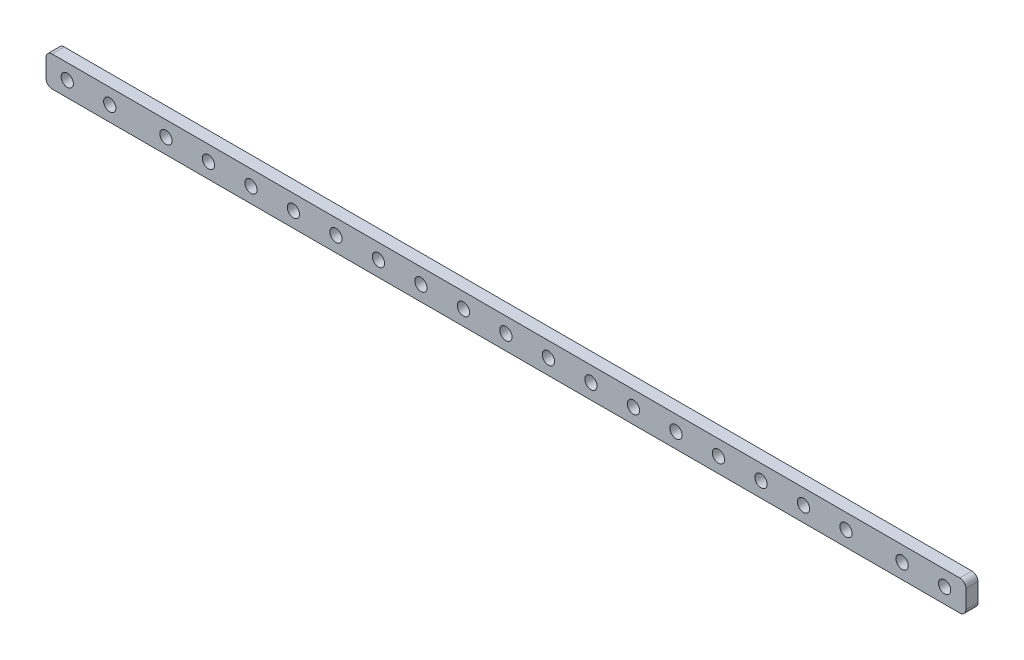
ISO-10303-21;
HEADER;
FILE_DESCRIPTION(('STEP AP214'),'2;1');
FILE_NAME('part.step','',(''),(''),'','','');
FILE_SCHEMA(('AUTOMOTIVE_DESIGN { 1 0 10303 214 1 1 1 1 }'));
ENDSEC;
DATA;
#1=APPLICATION_CONTEXT('core data for automotive mechanical design processes');
#2=APPLICATION_PROTOCOL_DEFINITION('international standard','automotive_design',2000,#1);
#3=PRODUCT_CONTEXT('',#1,'mechanical');
#4=PRODUCT('Part','Part','',(#3));
#5=PRODUCT_RELATED_PRODUCT_CATEGORY('part','',(#4));
#6=PRODUCT_DEFINITION_FORMATION('','',#4);
#7=PRODUCT_DEFINITION_CONTEXT('part definition',#1,'design');
#8=PRODUCT_DEFINITION('design','',#6,#7);
#9=PRODUCT_DEFINITION_SHAPE('','',#8);
#10=(LENGTH_UNIT() NAMED_UNIT(*) SI_UNIT(.MILLI.,.METRE.));
#11=(NAMED_UNIT(*) PLANE_ANGLE_UNIT() SI_UNIT($,.RADIAN.));
#12=(NAMED_UNIT(*) SI_UNIT($,.STERADIAN.) SOLID_ANGLE_UNIT());
#13=UNCERTAINTY_MEASURE_WITH_UNIT(LENGTH_MEASURE(1.E-05),#10,'distance_accuracy_value','');
#14=(GEOMETRIC_REPRESENTATION_CONTEXT(3) GLOBAL_UNCERTAINTY_ASSIGNED_CONTEXT((#13)) GLOBAL_UNIT_ASSIGNED_CONTEXT((#10,
#11,#12)) REPRESENTATION_CONTEXT('',''));
#15=CARTESIAN_POINT('',(0.,0.,0.));
#16=DIRECTION('',(0.,0.,1.));
#17=DIRECTION('',(1.,0.,0.));
#18=AXIS2_PLACEMENT_3D('',#15,#16,#17);
#19=CARTESIAN_POINT('',(0.,0.,4.));
#20=DIRECTION('',(0.,0.,-1.));
#21=DIRECTION('',(-1.,0.,0.));
#22=AXIS2_PLACEMENT_3D('',#19,#20,#21);
#23=PLANE('',#22);
#24=DIRECTION('',(1.,0.,0.));
#25=VECTOR('',#24,1.);
#26=CARTESIAN_POINT('',(-151.5,-5.,4.));
#27=LINE('',#26,#25);
#28=CARTESIAN_POINT('',(-149.5,-5.,4.));
#29=VERTEX_POINT('',#28);
#30=CARTESIAN_POINT('',(149.5,-5.,4.));
#31=VERTEX_POINT('',#30);
#32=EDGE_CURVE('E139',#29,#31,#27,.T.);
#33=ORIENTED_EDGE('',*,*,#32,.T.);
#34=CARTESIAN_POINT('',(149.5,-3.,4.));
#35=DIRECTION('',(0.,0.,-1.));
#36=DIRECTION('',(-1.,0.,0.));
#37=AXIS2_PLACEMENT_3D('',#34,#35,#36);
#38=CIRCLE('',#37,2.);
#39=CARTESIAN_POINT('',(151.5,-3.,4.));
#40=VERTEX_POINT('',#39);
#41=EDGE_CURVE('E157',#31,#40,#38,.F.);
#42=ORIENTED_EDGE('',*,*,#41,.T.);
#43=DIRECTION('',(0.,1.,0.));
#44=VECTOR('',#43,1.);
#45=CARTESIAN_POINT('',(151.5,-5.,4.));
#46=LINE('',#45,#44);
#47=CARTESIAN_POINT('',(151.5,3.,4.));
#48=VERTEX_POINT('',#47);
#49=EDGE_CURVE('E121',#40,#48,#46,.T.);
#50=ORIENTED_EDGE('',*,*,#49,.T.);
#51=CARTESIAN_POINT('',(149.5,3.,4.));
#52=DIRECTION('',(0.,0.,-1.));
#53=DIRECTION('',(-1.,0.,0.));
#54=AXIS2_PLACEMENT_3D('',#51,#52,#53);
#55=CIRCLE('',#54,2.);
#56=CARTESIAN_POINT('',(149.5,5.,4.));
#57=VERTEX_POINT('',#56);
#58=EDGE_CURVE('E153',#48,#57,#55,.F.);
#59=ORIENTED_EDGE('',*,*,#58,.T.);
#60=DIRECTION('',(-1.,0.,0.));
#61=VECTOR('',#60,1.);
#62=CARTESIAN_POINT('',(-151.5,5.,4.));
#63=LINE('',#62,#61);
#64=CARTESIAN_POINT('',(-149.5,5.,4.));
#65=VERTEX_POINT('',#64);
#66=EDGE_CURVE('E166',#57,#65,#63,.T.);
#67=ORIENTED_EDGE('',*,*,#66,.T.);
#68=CARTESIAN_POINT('',(-149.5,3.,4.));
#69=DIRECTION('',(0.,0.,-1.));
#70=DIRECTION('',(-1.,0.,0.));
#71=AXIS2_PLACEMENT_3D('',#68,#69,#70);
#72=CIRCLE('',#71,2.);
#73=CARTESIAN_POINT('',(-151.5,3.,4.));
#74=VERTEX_POINT('',#73);
#75=EDGE_CURVE('E56',#65,#74,#72,.F.);
#76=ORIENTED_EDGE('',*,*,#75,.T.);
#77=DIRECTION('',(0.,-1.,0.));
#78=VECTOR('',#77,1.);
#79=CARTESIAN_POINT('',(-151.5,-5.,4.));
#80=LINE('',#79,#78);
#81=CARTESIAN_POINT('',(-151.5,-3.,4.));
#82=VERTEX_POINT('',#81);
#83=EDGE_CURVE('E172',#74,#82,#80,.T.);
#84=ORIENTED_EDGE('',*,*,#83,.T.);
#85=CARTESIAN_POINT('',(-149.5,-3.,4.));
#86=DIRECTION('',(0.,0.,-1.));
#87=DIRECTION('',(-1.,0.,0.));
#88=AXIS2_PLACEMENT_3D('',#85,#86,#87);
#89=CIRCLE('',#88,2.);
#90=EDGE_CURVE('E155',#82,#29,#89,.F.);
#91=ORIENTED_EDGE('',*,*,#90,.T.);
#92=EDGE_LOOP('',(#33,#42,#50,#59,#67,#76,#84,#91));
#93=FACE_BOUND('',#92,.T.);
#94=CARTESIAN_POINT('',(-112.,0.,4.));
#95=DIRECTION('',(0.,0.,1.));
#96=DIRECTION('',(1.,0.,0.));
#97=AXIS2_PLACEMENT_3D('',#94,#95,#96);
#98=CIRCLE('',#97,2.02500000000001);
#99=CARTESIAN_POINT('',(-109.975,0.,4.));
#100=VERTEX_POINT('',#99);
#101=EDGE_CURVE('E130',#100,#100,#98,.T.);
#102=ORIENTED_EDGE('',*,*,#101,.F.);
#103=EDGE_LOOP('',(#102));
#104=FACE_BOUND('',#103,.T.);
#105=CARTESIAN_POINT('',(-97.9999999999999,0.,4.));
#106=DIRECTION('',(0.,0.,1.));
#107=DIRECTION('',(1.,0.,0.));
#108=AXIS2_PLACEMENT_3D('',#105,#106,#107);
#109=CIRCLE('',#108,2.02500000000001);
#110=CARTESIAN_POINT('',(-95.9749999999999,0.,4.));
#111=VERTEX_POINT('',#110);
#112=EDGE_CURVE('E187',#111,#111,#109,.T.);
#113=ORIENTED_EDGE('',*,*,#112,.F.);
#114=EDGE_LOOP('',(#113));
#115=FACE_BOUND('',#114,.T.);
#116=CARTESIAN_POINT('',(-130.5,0.,4.));
#117=DIRECTION('',(0.,0.,1.));
#118=DIRECTION('',(1.,0.,0.));
#119=AXIS2_PLACEMENT_3D('',#116,#117,#118);
#120=CIRCLE('',#119,2.02500000000001);
#121=CARTESIAN_POINT('',(-128.475,0.,4.));
#122=VERTEX_POINT('',#121);
#123=EDGE_CURVE('E192',#122,#122,#120,.T.);
#124=ORIENTED_EDGE('',*,*,#123,.F.);
#125=EDGE_LOOP('',(#124));
#126=FACE_BOUND('',#125,.T.);
#127=CARTESIAN_POINT('',(-83.9999999999999,0.,4.));
#128=DIRECTION('',(0.,0.,1.));
#129=DIRECTION('',(1.,0.,0.));
#130=AXIS2_PLACEMENT_3D('',#127,#128,#129);
#131=CIRCLE('',#130,2.02499999999999);
#132=CARTESIAN_POINT('',(-81.9749999999999,0.,4.));
#133=VERTEX_POINT('',#132);
#134=EDGE_CURVE('E198',#133,#133,#131,.T.);
#135=ORIENTED_EDGE('',*,*,#134,.F.);
#136=EDGE_LOOP('',(#135));
#137=FACE_BOUND('',#136,.T.);
#138=CARTESIAN_POINT('',(-69.9999999999999,0.,4.));
#139=DIRECTION('',(0.,0.,1.));
#140=DIRECTION('',(1.,0.,0.));
#141=AXIS2_PLACEMENT_3D('',#138,#139,#140);
#142=CIRCLE('',#141,2.02499999999999);
#143=CARTESIAN_POINT('',(-67.9749999999999,0.,4.));
#144=VERTEX_POINT('',#143);
#145=EDGE_CURVE('E204',#144,#144,#142,.T.);
#146=ORIENTED_EDGE('',*,*,#145,.F.);
#147=EDGE_LOOP('',(#146));
#148=FACE_BOUND('',#147,.T.);
#149=CARTESIAN_POINT('',(-55.9999999999999,0.,4.));
#150=DIRECTION('',(0.,0.,1.));
#151=DIRECTION('',(1.,0.,0.));
#152=AXIS2_PLACEMENT_3D('',#149,#150,#151);
#153=CIRCLE('',#152,2.02499999999999);
#154=CARTESIAN_POINT('',(-53.9749999999999,0.,4.));
#155=VERTEX_POINT('',#154);
#156=EDGE_CURVE('E210',#155,#155,#153,.T.);
#157=ORIENTED_EDGE('',*,*,#156,.F.);
#158=EDGE_LOOP('',(#157));
#159=FACE_BOUND('',#158,.T.);
#160=CARTESIAN_POINT('',(-41.9999999999999,0.,4.));
#161=DIRECTION('',(0.,0.,1.));
#162=DIRECTION('',(1.,0.,0.));
#163=AXIS2_PLACEMENT_3D('',#160,#161,#162);
#164=CIRCLE('',#163,2.02499999999999);
#165=CARTESIAN_POINT('',(-39.9749999999999,0.,4.));
#166=VERTEX_POINT('',#165);
#167=EDGE_CURVE('E216',#166,#166,#164,.T.);
#168=ORIENTED_EDGE('',*,*,#167,.F.);
#169=EDGE_LOOP('',(#168));
#170=FACE_BOUND('',#169,.T.);
#171=CARTESIAN_POINT('',(-28.,0.,4.));
#172=DIRECTION('',(0.,0.,1.));
#173=DIRECTION('',(1.,0.,0.));
#174=AXIS2_PLACEMENT_3D('',#171,#172,#173);
#175=CIRCLE('',#174,2.02499999999999);
#176=CARTESIAN_POINT('',(-25.975,0.,4.));
#177=VERTEX_POINT('',#176);
#178=EDGE_CURVE('E222',#177,#177,#175,.T.);
#179=ORIENTED_EDGE('',*,*,#178,.F.);
#180=EDGE_LOOP('',(#179));
#181=FACE_BOUND('',#180,.T.);
#182=CARTESIAN_POINT('',(-14.,0.,4.));
#183=DIRECTION('',(0.,0.,1.));
#184=DIRECTION('',(1.,0.,0.));
#185=AXIS2_PLACEMENT_3D('',#182,#183,#184);
#186=CIRCLE('',#185,2.02499999999999);
#187=CARTESIAN_POINT('',(-11.975,0.,4.));
#188=VERTEX_POINT('',#187);
#189=EDGE_CURVE('E228',#188,#188,#186,.T.);
#190=ORIENTED_EDGE('',*,*,#189,.F.);
#191=EDGE_LOOP('',(#190));
#192=FACE_BOUND('',#191,.T.);
#193=CARTESIAN_POINT('',(0.,0.,4.));
#194=DIRECTION('',(0.,0.,1.));
#195=DIRECTION('',(1.,0.,0.));
#196=AXIS2_PLACEMENT_3D('',#193,#194,#195);
#197=CIRCLE('',#196,2.02499999999999);
#198=CARTESIAN_POINT('',(2.02499999999999,0.,4.));
#199=VERTEX_POINT('',#198);
#200=EDGE_CURVE('E234',#199,#199,#197,.T.);
#201=ORIENTED_EDGE('',*,*,#200,.F.);
#202=EDGE_LOOP('',(#201));
#203=FACE_BOUND('',#202,.T.);
#204=CARTESIAN_POINT('',(14.,0.,4.));
#205=DIRECTION('',(0.,0.,1.));
#206=DIRECTION('',(1.,0.,0.));
#207=AXIS2_PLACEMENT_3D('',#204,#205,#206);
#208=CIRCLE('',#207,2.02499999999999);
#209=CARTESIAN_POINT('',(16.025,0.,4.));
#210=VERTEX_POINT('',#209);
#211=EDGE_CURVE('E240',#210,#210,#208,.T.);
#212=ORIENTED_EDGE('',*,*,#211,.F.);
#213=EDGE_LOOP('',(#212));
#214=FACE_BOUND('',#213,.T.);
#215=CARTESIAN_POINT('',(28.,0.,4.));
#216=DIRECTION('',(0.,0.,1.));
#217=DIRECTION('',(1.,0.,0.));
#218=AXIS2_PLACEMENT_3D('',#215,#216,#217);
#219=CIRCLE('',#218,2.02499999999999);
#220=CARTESIAN_POINT('',(30.025,0.,4.));
#221=VERTEX_POINT('',#220);
#222=EDGE_CURVE('E246',#221,#221,#219,.T.);
#223=ORIENTED_EDGE('',*,*,#222,.F.);
#224=EDGE_LOOP('',(#223));
#225=FACE_BOUND('',#224,.T.);
#226=CARTESIAN_POINT('',(42.,0.,4.));
#227=DIRECTION('',(0.,0.,1.));
#228=DIRECTION('',(1.,0.,0.));
#229=AXIS2_PLACEMENT_3D('',#226,#227,#228);
#230=CIRCLE('',#229,2.025);
#231=CARTESIAN_POINT('',(44.025,0.,4.));
#232=VERTEX_POINT('',#231);
#233=EDGE_CURVE('E252',#232,#232,#230,.T.);
#234=ORIENTED_EDGE('',*,*,#233,.F.);
#235=EDGE_LOOP('',(#234));
#236=FACE_BOUND('',#235,.T.);
#237=CARTESIAN_POINT('',(55.9999999999999,0.,4.));
#238=DIRECTION('',(0.,0.,1.));
#239=DIRECTION('',(1.,0.,0.));
#240=AXIS2_PLACEMENT_3D('',#237,#238,#239);
#241=CIRCLE('',#240,2.02499999999999);
#242=CARTESIAN_POINT('',(58.0249999999999,0.,4.));
#243=VERTEX_POINT('',#242);
#244=EDGE_CURVE('E258',#243,#243,#241,.T.);
#245=ORIENTED_EDGE('',*,*,#244,.F.);
#246=EDGE_LOOP('',(#245));
#247=FACE_BOUND('',#246,.T.);
#248=CARTESIAN_POINT('',(69.9999999999999,0.,4.));
#249=DIRECTION('',(0.,0.,1.));
#250=DIRECTION('',(1.,0.,0.));
#251=AXIS2_PLACEMENT_3D('',#248,#249,#250);
#252=CIRCLE('',#251,2.02499999999999);
#253=CARTESIAN_POINT('',(72.0249999999999,0.,4.));
#254=VERTEX_POINT('',#253);
#255=EDGE_CURVE('E264',#254,#254,#252,.T.);
#256=ORIENTED_EDGE('',*,*,#255,.F.);
#257=EDGE_LOOP('',(#256));
#258=FACE_BOUND('',#257,.T.);
#259=CARTESIAN_POINT('',(83.9999999999999,0.,4.));
#260=DIRECTION('',(0.,0.,1.));
#261=DIRECTION('',(1.,0.,0.));
#262=AXIS2_PLACEMENT_3D('',#259,#260,#261);
#263=CIRCLE('',#262,2.02499999999999);
#264=CARTESIAN_POINT('',(86.0249999999999,0.,4.));
#265=VERTEX_POINT('',#264);
#266=EDGE_CURVE('E270',#265,#265,#263,.T.);
#267=ORIENTED_EDGE('',*,*,#266,.F.);
#268=EDGE_LOOP('',(#267));
#269=FACE_BOUND('',#268,.T.);
#270=CARTESIAN_POINT('',(97.9999999999999,0.,4.));
#271=DIRECTION('',(0.,0.,1.));
#272=DIRECTION('',(1.,0.,0.));
#273=AXIS2_PLACEMENT_3D('',#270,#271,#272);
#274=CIRCLE('',#273,2.02500000000001);
#275=CARTESIAN_POINT('',(100.025,0.,4.));
#276=VERTEX_POINT('',#275);
#277=EDGE_CURVE('E276',#276,#276,#274,.T.);
#278=ORIENTED_EDGE('',*,*,#277,.F.);
#279=EDGE_LOOP('',(#278));
#280=FACE_BOUND('',#279,.T.);
#281=CARTESIAN_POINT('',(112.,0.,4.));
#282=DIRECTION('',(0.,0.,1.));
#283=DIRECTION('',(1.,0.,0.));
#284=AXIS2_PLACEMENT_3D('',#281,#282,#283);
#285=CIRCLE('',#284,2.02500000000001);
#286=CARTESIAN_POINT('',(114.025,0.,4.));
#287=VERTEX_POINT('',#286);
#288=EDGE_CURVE('E282',#287,#287,#285,.T.);
#289=ORIENTED_EDGE('',*,*,#288,.F.);
#290=EDGE_LOOP('',(#289));
#291=FACE_BOUND('',#290,.T.);
#292=CARTESIAN_POINT('',(130.5,0.,4.));
#293=DIRECTION('',(0.,0.,1.));
#294=DIRECTION('',(-1.,0.,0.));
#295=AXIS2_PLACEMENT_3D('',#292,#293,#294);
#296=CIRCLE('',#295,2.02500000000001);
#297=CARTESIAN_POINT('',(128.475,0.,4.));
#298=VERTEX_POINT('',#297);
#299=EDGE_CURVE('E288',#298,#298,#296,.T.);
#300=ORIENTED_EDGE('',*,*,#299,.F.);
#301=EDGE_LOOP('',(#300));
#302=FACE_BOUND('',#301,.T.);
#303=CARTESIAN_POINT('',(144.5,0.,4.));
#304=DIRECTION('',(0.,0.,1.));
#305=DIRECTION('',(-1.,0.,0.));
#306=AXIS2_PLACEMENT_3D('',#303,#304,#305);
#307=CIRCLE('',#306,2.02500000000001);
#308=CARTESIAN_POINT('',(142.475,0.,4.));
#309=VERTEX_POINT('',#308);
#310=EDGE_CURVE('E294',#309,#309,#307,.T.);
#311=ORIENTED_EDGE('',*,*,#310,.F.);
#312=EDGE_LOOP('',(#311));
#313=FACE_BOUND('',#312,.T.);
#314=CARTESIAN_POINT('',(-144.5,0.,4.));
#315=DIRECTION('',(0.,0.,1.));
#316=DIRECTION('',(1.,0.,0.));
#317=AXIS2_PLACEMENT_3D('',#314,#315,#316);
#318=CIRCLE('',#317,2.02500000000001);
#319=CARTESIAN_POINT('',(-142.475,0.,4.));
#320=VERTEX_POINT('',#319);
#321=EDGE_CURVE('E300',#320,#320,#318,.T.);
#322=ORIENTED_EDGE('',*,*,#321,.F.);
#323=EDGE_LOOP('',(#322));
#324=FACE_BOUND('',#323,.T.);
#325=ADVANCED_FACE('F34',(#93,#104,#115,#126,#137,#148,#159,#170,#181,#192,#203,#214,#225,#236,
#247,#258,#269,#280,#291,#302,#313,#324),#23,.F.);
#326=CARTESIAN_POINT('',(0.,0.,0.));
#327=DIRECTION('',(0.,0.,-1.));
#328=DIRECTION('',(-1.,0.,0.));
#329=AXIS2_PLACEMENT_3D('',#326,#327,#328);
#330=PLANE('',#329);
#331=CARTESIAN_POINT('',(144.5,0.,0.));
#332=DIRECTION('',(0.,0.,1.));
#333=DIRECTION('',(-1.,0.,0.));
#334=AXIS2_PLACEMENT_3D('',#331,#332,#333);
#335=CIRCLE('',#334,2.02500000000001);
#336=CARTESIAN_POINT('',(142.475,0.,0.));
#337=VERTEX_POINT('',#336);
#338=EDGE_CURVE('E297',#337,#337,#335,.T.);
#339=ORIENTED_EDGE('',*,*,#338,.T.);
#340=EDGE_LOOP('',(#339));
#341=FACE_BOUND('',#340,.T.);
#342=CARTESIAN_POINT('',(112.,0.,0.));
#343=DIRECTION('',(0.,0.,1.));
#344=DIRECTION('',(1.,0.,0.));
#345=AXIS2_PLACEMENT_3D('',#342,#343,#344);
#346=CIRCLE('',#345,2.02500000000001);
#347=CARTESIAN_POINT('',(114.025,0.,0.));
#348=VERTEX_POINT('',#347);
#349=EDGE_CURVE('E285',#348,#348,#346,.T.);
#350=ORIENTED_EDGE('',*,*,#349,.T.);
#351=EDGE_LOOP('',(#350));
#352=FACE_BOUND('',#351,.T.);
#353=CARTESIAN_POINT('',(83.9999999999999,0.,0.));
#354=DIRECTION('',(0.,0.,1.));
#355=DIRECTION('',(1.,0.,0.));
#356=AXIS2_PLACEMENT_3D('',#353,#354,#355);
#357=CIRCLE('',#356,2.02499999999999);
#358=CARTESIAN_POINT('',(86.0249999999999,0.,0.));
#359=VERTEX_POINT('',#358);
#360=EDGE_CURVE('E273',#359,#359,#357,.T.);
#361=ORIENTED_EDGE('',*,*,#360,.T.);
#362=EDGE_LOOP('',(#361));
#363=FACE_BOUND('',#362,.T.);
#364=CARTESIAN_POINT('',(55.9999999999999,0.,0.));
#365=DIRECTION('',(0.,0.,1.));
#366=DIRECTION('',(1.,0.,0.));
#367=AXIS2_PLACEMENT_3D('',#364,#365,#366);
#368=CIRCLE('',#367,2.02499999999999);
#369=CARTESIAN_POINT('',(58.0249999999999,0.,0.));
#370=VERTEX_POINT('',#369);
#371=EDGE_CURVE('E261',#370,#370,#368,.T.);
#372=ORIENTED_EDGE('',*,*,#371,.T.);
#373=EDGE_LOOP('',(#372));
#374=FACE_BOUND('',#373,.T.);
#375=CARTESIAN_POINT('',(28.,0.,0.));
#376=DIRECTION('',(0.,0.,1.));
#377=DIRECTION('',(1.,0.,0.));
#378=AXIS2_PLACEMENT_3D('',#375,#376,#377);
#379=CIRCLE('',#378,2.02499999999999);
#380=CARTESIAN_POINT('',(30.025,0.,0.));
#381=VERTEX_POINT('',#380);
#382=EDGE_CURVE('E249',#381,#381,#379,.T.);
#383=ORIENTED_EDGE('',*,*,#382,.T.);
#384=EDGE_LOOP('',(#383));
#385=FACE_BOUND('',#384,.T.);
#386=CARTESIAN_POINT('',(0.,0.,0.));
#387=DIRECTION('',(0.,0.,1.));
#388=DIRECTION('',(1.,0.,0.));
#389=AXIS2_PLACEMENT_3D('',#386,#387,#388);
#390=CIRCLE('',#389,2.02499999999999);
#391=CARTESIAN_POINT('',(2.02499999999999,0.,0.));
#392=VERTEX_POINT('',#391);
#393=EDGE_CURVE('E237',#392,#392,#390,.T.);
#394=ORIENTED_EDGE('',*,*,#393,.T.);
#395=EDGE_LOOP('',(#394));
#396=FACE_BOUND('',#395,.T.);
#397=CARTESIAN_POINT('',(-28.,0.,0.));
#398=DIRECTION('',(0.,0.,1.));
#399=DIRECTION('',(1.,0.,0.));
#400=AXIS2_PLACEMENT_3D('',#397,#398,#399);
#401=CIRCLE('',#400,2.02499999999999);
#402=CARTESIAN_POINT('',(-25.975,0.,0.));
#403=VERTEX_POINT('',#402);
#404=EDGE_CURVE('E225',#403,#403,#401,.T.);
#405=ORIENTED_EDGE('',*,*,#404,.T.);
#406=EDGE_LOOP('',(#405));
#407=FACE_BOUND('',#406,.T.);
#408=CARTESIAN_POINT('',(-55.9999999999999,0.,0.));
#409=DIRECTION('',(0.,0.,1.));
#410=DIRECTION('',(1.,0.,0.));
#411=AXIS2_PLACEMENT_3D('',#408,#409,#410);
#412=CIRCLE('',#411,2.02499999999999);
#413=CARTESIAN_POINT('',(-53.9749999999999,0.,0.));
#414=VERTEX_POINT('',#413);
#415=EDGE_CURVE('E213',#414,#414,#412,.T.);
#416=ORIENTED_EDGE('',*,*,#415,.T.);
#417=EDGE_LOOP('',(#416));
#418=FACE_BOUND('',#417,.T.);
#419=CARTESIAN_POINT('',(-83.9999999999999,0.,0.));
#420=DIRECTION('',(0.,0.,1.));
#421=DIRECTION('',(1.,0.,0.));
#422=AXIS2_PLACEMENT_3D('',#419,#420,#421);
#423=CIRCLE('',#422,2.02499999999999);
#424=CARTESIAN_POINT('',(-81.9749999999999,0.,0.));
#425=VERTEX_POINT('',#424);
#426=EDGE_CURVE('E201',#425,#425,#423,.T.);
#427=ORIENTED_EDGE('',*,*,#426,.T.);
#428=EDGE_LOOP('',(#427));
#429=FACE_BOUND('',#428,.T.);
#430=CARTESIAN_POINT('',(-97.9999999999999,0.,0.));
#431=DIRECTION('',(0.,0.,1.));
#432=DIRECTION('',(1.,0.,0.));
#433=AXIS2_PLACEMENT_3D('',#430,#431,#432);
#434=CIRCLE('',#433,2.02500000000001);
#435=CARTESIAN_POINT('',(-95.9749999999999,0.,0.));
#436=VERTEX_POINT('',#435);
#437=EDGE_CURVE('E189',#436,#436,#434,.T.);
#438=ORIENTED_EDGE('',*,*,#437,.T.);
#439=EDGE_LOOP('',(#438));
#440=FACE_BOUND('',#439,.T.);
#441=DIRECTION('',(0.,1.,0.));
#442=VECTOR('',#441,1.);
#443=CARTESIAN_POINT('',(151.5,-5.,0.));
#444=LINE('',#443,#442);
#445=CARTESIAN_POINT('',(151.5,-3.,0.));
#446=VERTEX_POINT('',#445);
#447=CARTESIAN_POINT('',(151.5,3.,0.));
#448=VERTEX_POINT('',#447);
#449=EDGE_CURVE('E118',#446,#448,#444,.T.);
#450=ORIENTED_EDGE('',*,*,#449,.F.);
#451=CARTESIAN_POINT('',(149.5,-3.,0.));
#452=DIRECTION('',(0.,0.,-1.));
#453=DIRECTION('',(-1.,0.,0.));
#454=AXIS2_PLACEMENT_3D('',#451,#452,#453);
#455=CIRCLE('',#454,2.);
#456=CARTESIAN_POINT('',(149.5,-5.,0.));
#457=VERTEX_POINT('',#456);
#458=EDGE_CURVE('E101',#446,#457,#455,.T.);
#459=ORIENTED_EDGE('',*,*,#458,.T.);
#460=DIRECTION('',(1.,0.,0.));
#461=VECTOR('',#460,1.);
#462=CARTESIAN_POINT('',(-151.5,-5.,0.));
#463=LINE('',#462,#461);
#464=CARTESIAN_POINT('',(-149.5,-5.,0.));
#465=VERTEX_POINT('',#464);
#466=EDGE_CURVE('E143',#465,#457,#463,.T.);
#467=ORIENTED_EDGE('',*,*,#466,.F.);
#468=CARTESIAN_POINT('',(-149.5,-3.,0.));
#469=DIRECTION('',(0.,0.,-1.));
#470=DIRECTION('',(-1.,0.,0.));
#471=AXIS2_PLACEMENT_3D('',#468,#469,#470);
#472=CIRCLE('',#471,2.);
#473=CARTESIAN_POINT('',(-151.5,-3.,0.));
#474=VERTEX_POINT('',#473);
#475=EDGE_CURVE('E112',#465,#474,#472,.T.);
#476=ORIENTED_EDGE('',*,*,#475,.T.);
#477=DIRECTION('',(0.,-1.,0.));
#478=VECTOR('',#477,1.);
#479=CARTESIAN_POINT('',(-151.5,-5.,0.));
#480=LINE('',#479,#478);
#481=CARTESIAN_POINT('',(-151.5,3.,0.));
#482=VERTEX_POINT('',#481);
#483=EDGE_CURVE('E133',#482,#474,#480,.T.);
#484=ORIENTED_EDGE('',*,*,#483,.F.);
#485=CARTESIAN_POINT('',(-149.5,3.,0.));
#486=DIRECTION('',(0.,0.,-1.));
#487=DIRECTION('',(-1.,0.,0.));
#488=AXIS2_PLACEMENT_3D('',#485,#486,#487);
#489=CIRCLE('',#488,2.);
#490=CARTESIAN_POINT('',(-149.5,5.,0.));
#491=VERTEX_POINT('',#490);
#492=EDGE_CURVE('E122',#482,#491,#489,.T.);
#493=ORIENTED_EDGE('',*,*,#492,.T.);
#494=DIRECTION('',(-1.,0.,0.));
#495=VECTOR('',#494,1.);
#496=CARTESIAN_POINT('',(-151.5,5.,0.));
#497=LINE('',#496,#495);
#498=CARTESIAN_POINT('',(149.5,5.,0.));
#499=VERTEX_POINT('',#498);
#500=EDGE_CURVE('E129',#499,#491,#497,.T.);
#501=ORIENTED_EDGE('',*,*,#500,.F.);
#502=CARTESIAN_POINT('',(149.5,3.,0.));
#503=DIRECTION('',(0.,0.,-1.));
#504=DIRECTION('',(-1.,0.,0.));
#505=AXIS2_PLACEMENT_3D('',#502,#503,#504);
#506=CIRCLE('',#505,2.);
#507=EDGE_CURVE('E128',#499,#448,#506,.T.);
#508=ORIENTED_EDGE('',*,*,#507,.T.);
#509=EDGE_LOOP('',(#450,#459,#467,#476,#484,#493,#501,#508));
#510=FACE_BOUND('',#509,.T.);
#511=CARTESIAN_POINT('',(-112.,0.,0.));
#512=DIRECTION('',(0.,0.,1.));
#513=DIRECTION('',(1.,0.,0.));
#514=AXIS2_PLACEMENT_3D('',#511,#512,#513);
#515=CIRCLE('',#514,2.02500000000001);
#516=CARTESIAN_POINT('',(-109.975,0.,0.));
#517=VERTEX_POINT('',#516);
#518=EDGE_CURVE('E136',#517,#517,#515,.T.);
#519=ORIENTED_EDGE('',*,*,#518,.T.);
#520=EDGE_LOOP('',(#519));
#521=FACE_BOUND('',#520,.T.);
#522=CARTESIAN_POINT('',(-130.5,0.,0.));
#523=DIRECTION('',(0.,0.,1.));
#524=DIRECTION('',(1.,0.,0.));
#525=AXIS2_PLACEMENT_3D('',#522,#523,#524);
#526=CIRCLE('',#525,2.02500000000001);
#527=CARTESIAN_POINT('',(-128.475,0.,0.));
#528=VERTEX_POINT('',#527);
#529=EDGE_CURVE('E195',#528,#528,#526,.T.);
#530=ORIENTED_EDGE('',*,*,#529,.T.);
#531=EDGE_LOOP('',(#530));
#532=FACE_BOUND('',#531,.T.);
#533=CARTESIAN_POINT('',(-69.9999999999999,0.,0.));
#534=DIRECTION('',(0.,0.,1.));
#535=DIRECTION('',(1.,0.,0.));
#536=AXIS2_PLACEMENT_3D('',#533,#534,#535);
#537=CIRCLE('',#536,2.02499999999999);
#538=CARTESIAN_POINT('',(-67.9749999999999,0.,0.));
#539=VERTEX_POINT('',#538);
#540=EDGE_CURVE('E207',#539,#539,#537,.T.);
#541=ORIENTED_EDGE('',*,*,#540,.T.);
#542=EDGE_LOOP('',(#541));
#543=FACE_BOUND('',#542,.T.);
#544=CARTESIAN_POINT('',(-41.9999999999999,0.,0.));
#545=DIRECTION('',(0.,0.,1.));
#546=DIRECTION('',(1.,0.,0.));
#547=AXIS2_PLACEMENT_3D('',#544,#545,#546);
#548=CIRCLE('',#547,2.02499999999999);
#549=CARTESIAN_POINT('',(-39.9749999999999,0.,0.));
#550=VERTEX_POINT('',#549);
#551=EDGE_CURVE('E219',#550,#550,#548,.T.);
#552=ORIENTED_EDGE('',*,*,#551,.T.);
#553=EDGE_LOOP('',(#552));
#554=FACE_BOUND('',#553,.T.);
#555=CARTESIAN_POINT('',(-14.,0.,0.));
#556=DIRECTION('',(0.,0.,1.));
#557=DIRECTION('',(1.,0.,0.));
#558=AXIS2_PLACEMENT_3D('',#555,#556,#557);
#559=CIRCLE('',#558,2.02499999999999);
#560=CARTESIAN_POINT('',(-11.975,0.,0.));
#561=VERTEX_POINT('',#560);
#562=EDGE_CURVE('E231',#561,#561,#559,.T.);
#563=ORIENTED_EDGE('',*,*,#562,.T.);
#564=EDGE_LOOP('',(#563));
#565=FACE_BOUND('',#564,.T.);
#566=CARTESIAN_POINT('',(14.,0.,0.));
#567=DIRECTION('',(0.,0.,1.));
#568=DIRECTION('',(1.,0.,0.));
#569=AXIS2_PLACEMENT_3D('',#566,#567,#568);
#570=CIRCLE('',#569,2.02499999999999);
#571=CARTESIAN_POINT('',(16.025,0.,0.));
#572=VERTEX_POINT('',#571);
#573=EDGE_CURVE('E243',#572,#572,#570,.T.);
#574=ORIENTED_EDGE('',*,*,#573,.T.);
#575=EDGE_LOOP('',(#574));
#576=FACE_BOUND('',#575,.T.);
#577=CARTESIAN_POINT('',(42.,0.,0.));
#578=DIRECTION('',(0.,0.,1.));
#579=DIRECTION('',(1.,0.,0.));
#580=AXIS2_PLACEMENT_3D('',#577,#578,#579);
#581=CIRCLE('',#580,2.025);
#582=CARTESIAN_POINT('',(44.025,0.,0.));
#583=VERTEX_POINT('',#582);
#584=EDGE_CURVE('E255',#583,#583,#581,.T.);
#585=ORIENTED_EDGE('',*,*,#584,.T.);
#586=EDGE_LOOP('',(#585));
#587=FACE_BOUND('',#586,.T.);
#588=CARTESIAN_POINT('',(69.9999999999999,0.,0.));
#589=DIRECTION('',(0.,0.,1.));
#590=DIRECTION('',(1.,0.,0.));
#591=AXIS2_PLACEMENT_3D('',#588,#589,#590);
#592=CIRCLE('',#591,2.02499999999999);
#593=CARTESIAN_POINT('',(72.0249999999999,0.,0.));
#594=VERTEX_POINT('',#593);
#595=EDGE_CURVE('E267',#594,#594,#592,.T.);
#596=ORIENTED_EDGE('',*,*,#595,.T.);
#597=EDGE_LOOP('',(#596));
#598=FACE_BOUND('',#597,.T.);
#599=CARTESIAN_POINT('',(97.9999999999999,0.,0.));
#600=DIRECTION('',(0.,0.,1.));
#601=DIRECTION('',(1.,0.,0.));
#602=AXIS2_PLACEMENT_3D('',#599,#600,#601);
#603=CIRCLE('',#602,2.02500000000001);
#604=CARTESIAN_POINT('',(100.025,0.,0.));
#605=VERTEX_POINT('',#604);
#606=EDGE_CURVE('E279',#605,#605,#603,.T.);
#607=ORIENTED_EDGE('',*,*,#606,.T.);
#608=EDGE_LOOP('',(#607));
#609=FACE_BOUND('',#608,.T.);
#610=CARTESIAN_POINT('',(130.5,0.,0.));
#611=DIRECTION('',(0.,0.,1.));
#612=DIRECTION('',(-1.,0.,0.));
#613=AXIS2_PLACEMENT_3D('',#610,#611,#612);
#614=CIRCLE('',#613,2.02500000000001);
#615=CARTESIAN_POINT('',(128.475,0.,0.));
#616=VERTEX_POINT('',#615);
#617=EDGE_CURVE('E291',#616,#616,#614,.T.);
#618=ORIENTED_EDGE('',*,*,#617,.T.);
#619=EDGE_LOOP('',(#618));
#620=FACE_BOUND('',#619,.T.);
#621=CARTESIAN_POINT('',(-144.5,0.,0.));
#622=DIRECTION('',(0.,0.,1.));
#623=DIRECTION('',(1.,0.,0.));
#624=AXIS2_PLACEMENT_3D('',#621,#622,#623);
#625=CIRCLE('',#624,2.02500000000001);
#626=CARTESIAN_POINT('',(-142.475,0.,0.));
#627=VERTEX_POINT('',#626);
#628=EDGE_CURVE('E303',#627,#627,#625,.T.);
#629=ORIENTED_EDGE('',*,*,#628,.T.);
#630=EDGE_LOOP('',(#629));
#631=FACE_BOUND('',#630,.T.);
#632=ADVANCED_FACE('F125',(#341,#352,#363,#374,#385,#396,#407,#418,#429,#440,#510,#521,#532,
#543,#554,#565,#576,#587,#598,#609,#620,#631),#330,.T.);
#633=CARTESIAN_POINT('',(151.5,-5.,4.));
#634=DIRECTION('',(-1.,0.,0.));
#635=DIRECTION('',(0.,0.,1.));
#636=AXIS2_PLACEMENT_3D('',#633,#634,#635);
#637=PLANE('',#636);
#638=ORIENTED_EDGE('',*,*,#49,.F.);
#639=DIRECTION('',(0.,0.,-1.));
#640=VECTOR('',#639,1.);
#641=CARTESIAN_POINT('',(151.5,-3.,4.));
#642=LINE('',#641,#640);
#643=EDGE_CURVE('E105',#40,#446,#642,.T.);
#644=ORIENTED_EDGE('',*,*,#643,.T.);
#645=ORIENTED_EDGE('',*,*,#449,.T.);
#646=DIRECTION('',(0.,0.,-1.));
#647=VECTOR('',#646,1.);
#648=CARTESIAN_POINT('',(151.5,3.,4.));
#649=LINE('',#648,#647);
#650=EDGE_CURVE('E123',#448,#48,#649,.F.);
#651=ORIENTED_EDGE('',*,*,#650,.T.);
#652=EDGE_LOOP('',(#638,#644,#645,#651));
#653=FACE_BOUND('',#652,.T.);
#654=ADVANCED_FACE('F117',(#653),#637,.F.);
#655=CARTESIAN_POINT('',(-151.5,5.,4.));
#656=DIRECTION('',(0.,-1.,0.));
#657=DIRECTION('',(0.,0.,-1.));
#658=AXIS2_PLACEMENT_3D('',#655,#656,#657);
#659=PLANE('',#658);
#660=ORIENTED_EDGE('',*,*,#66,.F.);
#661=DIRECTION('',(0.,0.,-1.));
#662=VECTOR('',#661,1.);
#663=CARTESIAN_POINT('',(149.5,5.,4.));
#664=LINE('',#663,#662);
#665=EDGE_CURVE('E11',#57,#499,#664,.T.);
#666=ORIENTED_EDGE('',*,*,#665,.T.);
#667=ORIENTED_EDGE('',*,*,#500,.T.);
#668=DIRECTION('',(0.,0.,-1.));
#669=VECTOR('',#668,1.);
#670=CARTESIAN_POINT('',(-149.5,5.,4.));
#671=LINE('',#670,#669);
#672=EDGE_CURVE('E42',#491,#65,#671,.F.);
#673=ORIENTED_EDGE('',*,*,#672,.T.);
#674=EDGE_LOOP('',(#660,#666,#667,#673));
#675=FACE_BOUND('',#674,.T.);
#676=ADVANCED_FACE('F165',(#675),#659,.F.);
#677=CARTESIAN_POINT('',(-151.5,-5.,4.));
#678=DIRECTION('',(1.,0.,0.));
#679=DIRECTION('',(0.,0.,-1.));
#680=AXIS2_PLACEMENT_3D('',#677,#678,#679);
#681=PLANE('',#680);
#682=ORIENTED_EDGE('',*,*,#483,.T.);
#683=DIRECTION('',(0.,0.,-1.));
#684=VECTOR('',#683,1.);
#685=CARTESIAN_POINT('',(-151.5,-3.,4.));
#686=LINE('',#685,#684);
#687=EDGE_CURVE('E49',#474,#82,#686,.F.);
#688=ORIENTED_EDGE('',*,*,#687,.T.);
#689=ORIENTED_EDGE('',*,*,#83,.F.);
#690=DIRECTION('',(0.,0.,-1.));
#691=VECTOR('',#690,1.);
#692=CARTESIAN_POINT('',(-151.5,3.,4.));
#693=LINE('',#692,#691);
#694=EDGE_CURVE('E159',#74,#482,#693,.T.);
#695=ORIENTED_EDGE('',*,*,#694,.T.);
#696=EDGE_LOOP('',(#682,#688,#689,#695));
#697=FACE_BOUND('',#696,.T.);
#698=ADVANCED_FACE('F176',(#697),#681,.F.);
#699=CARTESIAN_POINT('',(-151.5,-5.,4.));
#700=DIRECTION('',(0.,1.,0.));
#701=DIRECTION('',(0.,0.,1.));
#702=AXIS2_PLACEMENT_3D('',#699,#700,#701);
#703=PLANE('',#702);
#704=ORIENTED_EDGE('',*,*,#466,.T.);
#705=DIRECTION('',(0.,0.,-1.));
#706=VECTOR('',#705,1.);
#707=CARTESIAN_POINT('',(149.5,-5.,4.));
#708=LINE('',#707,#706);
#709=EDGE_CURVE('E106',#457,#31,#708,.F.);
#710=ORIENTED_EDGE('',*,*,#709,.T.);
#711=ORIENTED_EDGE('',*,*,#32,.F.);
#712=DIRECTION('',(0.,0.,-1.));
#713=VECTOR('',#712,1.);
#714=CARTESIAN_POINT('',(-149.5,-5.,4.));
#715=LINE('',#714,#713);
#716=EDGE_CURVE('E111',#29,#465,#715,.T.);
#717=ORIENTED_EDGE('',*,*,#716,.T.);
#718=EDGE_LOOP('',(#704,#710,#711,#717));
#719=FACE_BOUND('',#718,.T.);
#720=ADVANCED_FACE('F183',(#719),#703,.F.);
#721=CARTESIAN_POINT('',(-112.,0.,4.));
#722=DIRECTION('',(0.,0.,-1.));
#723=DIRECTION('',(-1.,0.,0.));
#724=AXIS2_PLACEMENT_3D('',#721,#722,#723);
#725=CYLINDRICAL_SURFACE('',#724,2.02500000000001);
#726=ORIENTED_EDGE('',*,*,#101,.T.);
#727=EDGE_LOOP('',(#726));
#728=FACE_BOUND('',#727,.T.);
#729=ORIENTED_EDGE('',*,*,#518,.F.);
#730=EDGE_LOOP('',(#729));
#731=FACE_BOUND('',#730,.T.);
#732=ADVANCED_FACE('F320',(#728,#731),#725,.F.);
#733=CARTESIAN_POINT('',(-97.9999999999999,0.,4.));
#734=DIRECTION('',(0.,0.,-1.));
#735=DIRECTION('',(-1.,0.,0.));
#736=AXIS2_PLACEMENT_3D('',#733,#734,#735);
#737=CYLINDRICAL_SURFACE('',#736,2.02500000000001);
#738=ORIENTED_EDGE('',*,*,#112,.T.);
#739=EDGE_LOOP('',(#738));
#740=FACE_BOUND('',#739,.T.);
#741=ORIENTED_EDGE('',*,*,#437,.F.);
#742=EDGE_LOOP('',(#741));
#743=FACE_BOUND('',#742,.T.);
#744=ADVANCED_FACE('F582',(#740,#743),#737,.F.);
#745=CARTESIAN_POINT('',(-130.5,0.,4.));
#746=DIRECTION('',(0.,0.,-1.));
#747=DIRECTION('',(-1.,0.,0.));
#748=AXIS2_PLACEMENT_3D('',#745,#746,#747);
#749=CYLINDRICAL_SURFACE('',#748,2.02500000000001);
#750=ORIENTED_EDGE('',*,*,#123,.T.);
#751=EDGE_LOOP('',(#750));
#752=FACE_BOUND('',#751,.T.);
#753=ORIENTED_EDGE('',*,*,#529,.F.);
#754=EDGE_LOOP('',(#753));
#755=FACE_BOUND('',#754,.T.);
#756=ADVANCED_FACE('F572',(#752,#755),#749,.F.);
#757=CARTESIAN_POINT('',(-83.9999999999999,0.,4.));
#758=DIRECTION('',(0.,0.,-1.));
#759=DIRECTION('',(-1.,0.,0.));
#760=AXIS2_PLACEMENT_3D('',#757,#758,#759);
#761=CYLINDRICAL_SURFACE('',#760,2.02499999999999);
#762=ORIENTED_EDGE('',*,*,#134,.T.);
#763=EDGE_LOOP('',(#762));
#764=FACE_BOUND('',#763,.T.);
#765=ORIENTED_EDGE('',*,*,#426,.F.);
#766=EDGE_LOOP('',(#765));
#767=FACE_BOUND('',#766,.T.);
#768=ADVANCED_FACE('F562',(#764,#767),#761,.F.);
#769=CARTESIAN_POINT('',(-69.9999999999999,0.,4.));
#770=DIRECTION('',(0.,0.,-1.));
#771=DIRECTION('',(-1.,0.,0.));
#772=AXIS2_PLACEMENT_3D('',#769,#770,#771);
#773=CYLINDRICAL_SURFACE('',#772,2.02499999999999);
#774=ORIENTED_EDGE('',*,*,#145,.T.);
#775=EDGE_LOOP('',(#774));
#776=FACE_BOUND('',#775,.T.);
#777=ORIENTED_EDGE('',*,*,#540,.F.);
#778=EDGE_LOOP('',(#777));
#779=FACE_BOUND('',#778,.T.);
#780=ADVANCED_FACE('F552',(#776,#779),#773,.F.);
#781=CARTESIAN_POINT('',(-55.9999999999999,0.,4.));
#782=DIRECTION('',(0.,0.,-1.));
#783=DIRECTION('',(-1.,0.,0.));
#784=AXIS2_PLACEMENT_3D('',#781,#782,#783);
#785=CYLINDRICAL_SURFACE('',#784,2.02499999999999);
#786=ORIENTED_EDGE('',*,*,#156,.T.);
#787=EDGE_LOOP('',(#786));
#788=FACE_BOUND('',#787,.T.);
#789=ORIENTED_EDGE('',*,*,#415,.F.);
#790=EDGE_LOOP('',(#789));
#791=FACE_BOUND('',#790,.T.);
#792=ADVANCED_FACE('F542',(#788,#791),#785,.F.);
#793=CARTESIAN_POINT('',(-41.9999999999999,0.,4.));
#794=DIRECTION('',(0.,0.,-1.));
#795=DIRECTION('',(-1.,0.,0.));
#796=AXIS2_PLACEMENT_3D('',#793,#794,#795);
#797=CYLINDRICAL_SURFACE('',#796,2.02499999999999);
#798=ORIENTED_EDGE('',*,*,#167,.T.);
#799=EDGE_LOOP('',(#798));
#800=FACE_BOUND('',#799,.T.);
#801=ORIENTED_EDGE('',*,*,#551,.F.);
#802=EDGE_LOOP('',(#801));
#803=FACE_BOUND('',#802,.T.);
#804=ADVANCED_FACE('F532',(#800,#803),#797,.F.);
#805=CARTESIAN_POINT('',(-28.,0.,4.));
#806=DIRECTION('',(0.,0.,-1.));
#807=DIRECTION('',(-1.,0.,0.));
#808=AXIS2_PLACEMENT_3D('',#805,#806,#807);
#809=CYLINDRICAL_SURFACE('',#808,2.02499999999999);
#810=ORIENTED_EDGE('',*,*,#178,.T.);
#811=EDGE_LOOP('',(#810));
#812=FACE_BOUND('',#811,.T.);
#813=ORIENTED_EDGE('',*,*,#404,.F.);
#814=EDGE_LOOP('',(#813));
#815=FACE_BOUND('',#814,.T.);
#816=ADVANCED_FACE('F522',(#812,#815),#809,.F.);
#817=CARTESIAN_POINT('',(-14.,0.,4.));
#818=DIRECTION('',(0.,0.,-1.));
#819=DIRECTION('',(-1.,0.,0.));
#820=AXIS2_PLACEMENT_3D('',#817,#818,#819);
#821=CYLINDRICAL_SURFACE('',#820,2.02499999999999);
#822=ORIENTED_EDGE('',*,*,#189,.T.);
#823=EDGE_LOOP('',(#822));
#824=FACE_BOUND('',#823,.T.);
#825=ORIENTED_EDGE('',*,*,#562,.F.);
#826=EDGE_LOOP('',(#825));
#827=FACE_BOUND('',#826,.T.);
#828=ADVANCED_FACE('F512',(#824,#827),#821,.F.);
#829=CARTESIAN_POINT('',(0.,0.,4.));
#830=DIRECTION('',(0.,0.,-1.));
#831=DIRECTION('',(-1.,0.,0.));
#832=AXIS2_PLACEMENT_3D('',#829,#830,#831);
#833=CYLINDRICAL_SURFACE('',#832,2.02499999999999);
#834=ORIENTED_EDGE('',*,*,#200,.T.);
#835=EDGE_LOOP('',(#834));
#836=FACE_BOUND('',#835,.T.);
#837=ORIENTED_EDGE('',*,*,#393,.F.);
#838=EDGE_LOOP('',(#837));
#839=FACE_BOUND('',#838,.T.);
#840=ADVANCED_FACE('F502',(#836,#839),#833,.F.);
#841=CARTESIAN_POINT('',(14.,0.,4.));
#842=DIRECTION('',(0.,0.,-1.));
#843=DIRECTION('',(-1.,0.,0.));
#844=AXIS2_PLACEMENT_3D('',#841,#842,#843);
#845=CYLINDRICAL_SURFACE('',#844,2.02499999999999);
#846=ORIENTED_EDGE('',*,*,#211,.T.);
#847=EDGE_LOOP('',(#846));
#848=FACE_BOUND('',#847,.T.);
#849=ORIENTED_EDGE('',*,*,#573,.F.);
#850=EDGE_LOOP('',(#849));
#851=FACE_BOUND('',#850,.T.);
#852=ADVANCED_FACE('F492',(#848,#851),#845,.F.);
#853=CARTESIAN_POINT('',(28.,0.,4.));
#854=DIRECTION('',(0.,0.,-1.));
#855=DIRECTION('',(-1.,0.,0.));
#856=AXIS2_PLACEMENT_3D('',#853,#854,#855);
#857=CYLINDRICAL_SURFACE('',#856,2.02499999999999);
#858=ORIENTED_EDGE('',*,*,#222,.T.);
#859=EDGE_LOOP('',(#858));
#860=FACE_BOUND('',#859,.T.);
#861=ORIENTED_EDGE('',*,*,#382,.F.);
#862=EDGE_LOOP('',(#861));
#863=FACE_BOUND('',#862,.T.);
#864=ADVANCED_FACE('F482',(#860,#863),#857,.F.);
#865=CARTESIAN_POINT('',(42.,0.,4.));
#866=DIRECTION('',(0.,0.,-1.));
#867=DIRECTION('',(-1.,0.,0.));
#868=AXIS2_PLACEMENT_3D('',#865,#866,#867);
#869=CYLINDRICAL_SURFACE('',#868,2.025);
#870=ORIENTED_EDGE('',*,*,#233,.T.);
#871=EDGE_LOOP('',(#870));
#872=FACE_BOUND('',#871,.T.);
#873=ORIENTED_EDGE('',*,*,#584,.F.);
#874=EDGE_LOOP('',(#873));
#875=FACE_BOUND('',#874,.T.);
#876=ADVANCED_FACE('F472',(#872,#875),#869,.F.);
#877=CARTESIAN_POINT('',(55.9999999999999,0.,4.));
#878=DIRECTION('',(0.,0.,-1.));
#879=DIRECTION('',(-1.,0.,0.));
#880=AXIS2_PLACEMENT_3D('',#877,#878,#879);
#881=CYLINDRICAL_SURFACE('',#880,2.02499999999999);
#882=ORIENTED_EDGE('',*,*,#244,.T.);
#883=EDGE_LOOP('',(#882));
#884=FACE_BOUND('',#883,.T.);
#885=ORIENTED_EDGE('',*,*,#371,.F.);
#886=EDGE_LOOP('',(#885));
#887=FACE_BOUND('',#886,.T.);
#888=ADVANCED_FACE('F462',(#884,#887),#881,.F.);
#889=CARTESIAN_POINT('',(69.9999999999999,0.,4.));
#890=DIRECTION('',(0.,0.,-1.));
#891=DIRECTION('',(-1.,0.,0.));
#892=AXIS2_PLACEMENT_3D('',#889,#890,#891);
#893=CYLINDRICAL_SURFACE('',#892,2.02499999999999);
#894=ORIENTED_EDGE('',*,*,#255,.T.);
#895=EDGE_LOOP('',(#894));
#896=FACE_BOUND('',#895,.T.);
#897=ORIENTED_EDGE('',*,*,#595,.F.);
#898=EDGE_LOOP('',(#897));
#899=FACE_BOUND('',#898,.T.);
#900=ADVANCED_FACE('F452',(#896,#899),#893,.F.);
#901=CARTESIAN_POINT('',(83.9999999999999,0.,4.));
#902=DIRECTION('',(0.,0.,-1.));
#903=DIRECTION('',(-1.,0.,0.));
#904=AXIS2_PLACEMENT_3D('',#901,#902,#903);
#905=CYLINDRICAL_SURFACE('',#904,2.02499999999999);
#906=ORIENTED_EDGE('',*,*,#266,.T.);
#907=EDGE_LOOP('',(#906));
#908=FACE_BOUND('',#907,.T.);
#909=ORIENTED_EDGE('',*,*,#360,.F.);
#910=EDGE_LOOP('',(#909));
#911=FACE_BOUND('',#910,.T.);
#912=ADVANCED_FACE('F442',(#908,#911),#905,.F.);
#913=CARTESIAN_POINT('',(97.9999999999999,0.,4.));
#914=DIRECTION('',(0.,0.,-1.));
#915=DIRECTION('',(-1.,0.,0.));
#916=AXIS2_PLACEMENT_3D('',#913,#914,#915);
#917=CYLINDRICAL_SURFACE('',#916,2.02500000000001);
#918=ORIENTED_EDGE('',*,*,#277,.T.);
#919=EDGE_LOOP('',(#918));
#920=FACE_BOUND('',#919,.T.);
#921=ORIENTED_EDGE('',*,*,#606,.F.);
#922=EDGE_LOOP('',(#921));
#923=FACE_BOUND('',#922,.T.);
#924=ADVANCED_FACE('F432',(#920,#923),#917,.F.);
#925=CARTESIAN_POINT('',(112.,0.,4.));
#926=DIRECTION('',(0.,0.,-1.));
#927=DIRECTION('',(-1.,0.,0.));
#928=AXIS2_PLACEMENT_3D('',#925,#926,#927);
#929=CYLINDRICAL_SURFACE('',#928,2.02500000000001);
#930=ORIENTED_EDGE('',*,*,#288,.T.);
#931=EDGE_LOOP('',(#930));
#932=FACE_BOUND('',#931,.T.);
#933=ORIENTED_EDGE('',*,*,#349,.F.);
#934=EDGE_LOOP('',(#933));
#935=FACE_BOUND('',#934,.T.);
#936=ADVANCED_FACE('F422',(#932,#935),#929,.F.);
#937=CARTESIAN_POINT('',(130.5,0.,4.));
#938=DIRECTION('',(0.,0.,-1.));
#939=DIRECTION('',(-1.,0.,0.));
#940=AXIS2_PLACEMENT_3D('',#937,#938,#939);
#941=CYLINDRICAL_SURFACE('',#940,2.02500000000001);
#942=ORIENTED_EDGE('',*,*,#299,.T.);
#943=EDGE_LOOP('',(#942));
#944=FACE_BOUND('',#943,.T.);
#945=ORIENTED_EDGE('',*,*,#617,.F.);
#946=EDGE_LOOP('',(#945));
#947=FACE_BOUND('',#946,.T.);
#948=ADVANCED_FACE('F412',(#944,#947),#941,.F.);
#949=CARTESIAN_POINT('',(144.5,0.,4.));
#950=DIRECTION('',(0.,0.,-1.));
#951=DIRECTION('',(-1.,0.,0.));
#952=AXIS2_PLACEMENT_3D('',#949,#950,#951);
#953=CYLINDRICAL_SURFACE('',#952,2.02500000000001);
#954=ORIENTED_EDGE('',*,*,#310,.T.);
#955=EDGE_LOOP('',(#954));
#956=FACE_BOUND('',#955,.T.);
#957=ORIENTED_EDGE('',*,*,#338,.F.);
#958=EDGE_LOOP('',(#957));
#959=FACE_BOUND('',#958,.T.);
#960=ADVANCED_FACE('F403',(#956,#959),#953,.F.);
#961=CARTESIAN_POINT('',(-144.5,0.,4.));
#962=DIRECTION('',(0.,0.,-1.));
#963=DIRECTION('',(-1.,0.,0.));
#964=AXIS2_PLACEMENT_3D('',#961,#962,#963);
#965=CYLINDRICAL_SURFACE('',#964,2.02500000000001);
#966=ORIENTED_EDGE('',*,*,#321,.T.);
#967=EDGE_LOOP('',(#966));
#968=FACE_BOUND('',#967,.T.);
#969=ORIENTED_EDGE('',*,*,#628,.F.);
#970=EDGE_LOOP('',(#969));
#971=FACE_BOUND('',#970,.T.);
#972=ADVANCED_FACE('F309',(#968,#971),#965,.F.);
#973=CARTESIAN_POINT('',(149.5,-3.,4.));
#974=DIRECTION('',(0.,0.,-1.));
#975=DIRECTION('',(-1.,0.,0.));
#976=AXIS2_PLACEMENT_3D('',#973,#974,#975);
#977=CYLINDRICAL_SURFACE('',#976,2.);
#978=ORIENTED_EDGE('',*,*,#41,.F.);
#979=ORIENTED_EDGE('',*,*,#709,.F.);
#980=ORIENTED_EDGE('',*,*,#458,.F.);
#981=ORIENTED_EDGE('',*,*,#643,.F.);
#982=EDGE_LOOP('',(#978,#979,#980,#981));
#983=FACE_BOUND('',#982,.T.);
#984=ADVANCED_FACE('F104',(#983),#977,.T.);
#985=CARTESIAN_POINT('',(-149.5,-3.,4.));
#986=DIRECTION('',(0.,0.,-1.));
#987=DIRECTION('',(-1.,0.,0.));
#988=AXIS2_PLACEMENT_3D('',#985,#986,#987);
#989=CYLINDRICAL_SURFACE('',#988,2.);
#990=ORIENTED_EDGE('',*,*,#90,.F.);
#991=ORIENTED_EDGE('',*,*,#687,.F.);
#992=ORIENTED_EDGE('',*,*,#475,.F.);
#993=ORIENTED_EDGE('',*,*,#716,.F.);
#994=EDGE_LOOP('',(#990,#991,#992,#993));
#995=FACE_BOUND('',#994,.T.);
#996=ADVANCED_FACE('F180',(#995),#989,.T.);
#997=CARTESIAN_POINT('',(149.5,3.,4.));
#998=DIRECTION('',(0.,0.,-1.));
#999=DIRECTION('',(-1.,0.,0.));
#1000=AXIS2_PLACEMENT_3D('',#997,#998,#999);
#1001=CYLINDRICAL_SURFACE('',#1000,2.);
#1002=ORIENTED_EDGE('',*,*,#58,.F.);
#1003=ORIENTED_EDGE('',*,*,#650,.F.);
#1004=ORIENTED_EDGE('',*,*,#507,.F.);
#1005=ORIENTED_EDGE('',*,*,#665,.F.);
#1006=EDGE_LOOP('',(#1002,#1003,#1004,#1005));
#1007=FACE_BOUND('',#1006,.T.);
#1008=ADVANCED_FACE('F334',(#1007),#1001,.T.);
#1009=CARTESIAN_POINT('',(-149.5,3.,4.));
#1010=DIRECTION('',(0.,0.,-1.));
#1011=DIRECTION('',(-1.,0.,0.));
#1012=AXIS2_PLACEMENT_3D('',#1009,#1010,#1011);
#1013=CYLINDRICAL_SURFACE('',#1012,2.);
#1014=ORIENTED_EDGE('',*,*,#75,.F.);
#1015=ORIENTED_EDGE('',*,*,#672,.F.);
#1016=ORIENTED_EDGE('',*,*,#492,.F.);
#1017=ORIENTED_EDGE('',*,*,#694,.F.);
#1018=EDGE_LOOP('',(#1014,#1015,#1016,#1017));
#1019=FACE_BOUND('',#1018,.T.);
#1020=ADVANCED_FACE('F36',(#1019),#1013,.T.);
#1021=CLOSED_SHELL('',(#325,#632,#654,#676,#698,#720,#732,#744,#756,#768,#780,#792,#804,#816,
#828,#840,#852,#864,#876,#888,#900,#912,#924,#936,#948,#960,#972,#984,#996,#1008,#1020));
#1022=MANIFOLD_SOLID_BREP('B2',#1021);
#1023=ADVANCED_BREP_SHAPE_REPRESENTATION('',(#18,#1022),#14);
#1024=SHAPE_DEFINITION_REPRESENTATION(#9,#1023);
ENDSEC;
END-ISO-10303-21;
